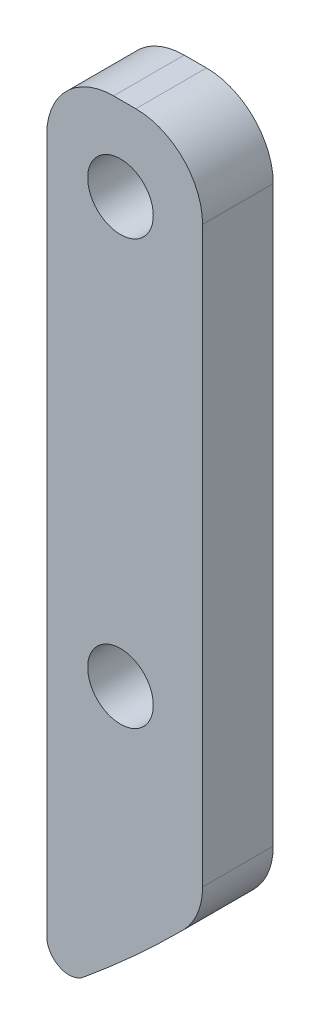
ISO-10303-21;
HEADER;
FILE_DESCRIPTION(('STEP AP214'),'2;1');
FILE_NAME('part.step','',(''),(''),'','','');
FILE_SCHEMA(('AUTOMOTIVE_DESIGN { 1 0 10303 214 1 1 1 1 }'));
ENDSEC;
DATA;
#1=APPLICATION_CONTEXT('core data for automotive mechanical design processes');
#2=APPLICATION_PROTOCOL_DEFINITION('international standard','automotive_design',2000,#1);
#3=PRODUCT_CONTEXT('',#1,'mechanical');
#4=PRODUCT('Part','Part','',(#3));
#5=PRODUCT_RELATED_PRODUCT_CATEGORY('part','',(#4));
#6=PRODUCT_DEFINITION_FORMATION('','',#4);
#7=PRODUCT_DEFINITION_CONTEXT('part definition',#1,'design');
#8=PRODUCT_DEFINITION('design','',#6,#7);
#9=PRODUCT_DEFINITION_SHAPE('','',#8);
#10=(LENGTH_UNIT() NAMED_UNIT(*) SI_UNIT(.MILLI.,.METRE.));
#11=(NAMED_UNIT(*) PLANE_ANGLE_UNIT() SI_UNIT($,.RADIAN.));
#12=(NAMED_UNIT(*) SI_UNIT($,.STERADIAN.) SOLID_ANGLE_UNIT());
#13=UNCERTAINTY_MEASURE_WITH_UNIT(LENGTH_MEASURE(1.E-05),#10,'distance_accuracy_value','');
#14=(GEOMETRIC_REPRESENTATION_CONTEXT(3) GLOBAL_UNCERTAINTY_ASSIGNED_CONTEXT((#13)) GLOBAL_UNIT_ASSIGNED_CONTEXT((#10,
#11,#12)) REPRESENTATION_CONTEXT('',''));
#15=CARTESIAN_POINT('',(0.,0.,0.));
#16=DIRECTION('',(0.,0.,1.));
#17=DIRECTION('',(1.,0.,0.));
#18=AXIS2_PLACEMENT_3D('',#15,#16,#17);
#19=CARTESIAN_POINT('',(-6.92429051442528E-10,7.03290897741127E-09,3.175));
#20=DIRECTION('',(0.,0.,1.));
#21=DIRECTION('',(1.,0.,0.));
#22=AXIS2_PLACEMENT_3D('',#19,#20,#21);
#23=PLANE('',#22);
#24=CARTESIAN_POINT('',(40.8118922104986,-16.3543111861162,3.175));
#25=DIRECTION('',(0.,0.,1.));
#26=DIRECTION('',(1.,0.,0.));
#27=AXIS2_PLACEMENT_3D('',#24,#25,#26);
#28=CIRCLE('',#27,1.4732);
#29=CARTESIAN_POINT('',(42.2850922104986,-16.3543111861162,3.175));
#30=VERTEX_POINT('',#29);
#31=EDGE_CURVE('E141',#30,#30,#28,.T.);
#32=ORIENTED_EDGE('',*,*,#31,.F.);
#33=EDGE_LOOP('',(#32));
#34=FACE_BOUND('',#33,.T.);
#35=DIRECTION('',(0.,-1.,0.));
#36=VECTOR('',#35,1.);
#37=CARTESIAN_POINT('',(37.5,-12.5874867185186,3.175));
#38=LINE('',#37,#36);
#39=CARTESIAN_POINT('',(37.5,-15.5874867185186,3.175));
#40=VERTEX_POINT('',#39);
#41=CARTESIAN_POINT('',(37.5,-46.7921363579228,3.175));
#42=VERTEX_POINT('',#41);
#43=EDGE_CURVE('E125',#40,#42,#38,.T.);
#44=ORIENTED_EDGE('',*,*,#43,.T.);
#45=CARTESIAN_POINT('',(38.5,-46.7921363579228,3.175));
#46=DIRECTION('',(0.,0.,1.));
#47=DIRECTION('',(1.,0.,0.));
#48=AXIS2_PLACEMENT_3D('',#45,#46,#47);
#49=CIRCLE('',#48,1.);
#50=CARTESIAN_POINT('',(39.1353659542418,-47.5643475364163,3.175));
#51=VERTEX_POINT('',#50);
#52=EDGE_CURVE('E12',#42,#51,#49,.T.);
#53=ORIENTED_EDGE('',*,*,#52,.T.);
#54=CARTESIAN_POINT('',(-6.92429051442528E-10,7.03290897741127E-09,3.175));
#55=DIRECTION('',(0.,0.,1.));
#56=DIRECTION('',(1.,0.,0.));
#57=AXIS2_PLACEMENT_3D('',#54,#55,#56);
#58=CIRCLE('',#57,61.5950000053629);
#59=CARTESIAN_POINT('',(43.6247546717413,-43.4836153604894,3.175));
#60=VERTEX_POINT('',#59);
#61=EDGE_CURVE('E205',#51,#60,#58,.T.);
#62=ORIENTED_EDGE('',*,*,#61,.T.);
#63=CARTESIAN_POINT('',(41.5,-41.3657349141673,3.175));
#64=DIRECTION('',(0.,0.,1.));
#65=DIRECTION('',(1.,0.,0.));
#66=AXIS2_PLACEMENT_3D('',#63,#64,#65);
#67=CIRCLE('',#66,3.);
#68=CARTESIAN_POINT('',(44.5,-41.3657349141673,3.175));
#69=VERTEX_POINT('',#68);
#70=EDGE_CURVE('E159',#60,#69,#67,.T.);
#71=ORIENTED_EDGE('',*,*,#70,.T.);
#72=DIRECTION('',(0.,1.,0.));
#73=VECTOR('',#72,1.);
#74=CARTESIAN_POINT('',(44.5,-41.3657349141671,3.175));
#75=LINE('',#74,#73);
#76=CARTESIAN_POINT('',(44.4999999999994,-15.5874867185186,3.175));
#77=VERTEX_POINT('',#76);
#78=EDGE_CURVE('E128',#69,#77,#75,.T.);
#79=ORIENTED_EDGE('',*,*,#78,.T.);
#80=CARTESIAN_POINT('',(41.5,-15.5874867185186,3.175));
#81=DIRECTION('',(0.,0.,1.));
#82=DIRECTION('',(1.,0.,0.));
#83=AXIS2_PLACEMENT_3D('',#80,#81,#82);
#84=CIRCLE('',#83,3.);
#85=CARTESIAN_POINT('',(41.5,-12.5874867185186,3.175));
#86=VERTEX_POINT('',#85);
#87=EDGE_CURVE('E162',#77,#86,#84,.T.);
#88=ORIENTED_EDGE('',*,*,#87,.T.);
#89=DIRECTION('',(-1.,0.,0.));
#90=VECTOR('',#89,1.);
#91=CARTESIAN_POINT('',(44.5,-12.5874867185186,3.175));
#92=LINE('',#91,#90);
#93=CARTESIAN_POINT('',(40.5,-12.5874867185186,3.175));
#94=VERTEX_POINT('',#93);
#95=EDGE_CURVE('E147',#86,#94,#92,.T.);
#96=ORIENTED_EDGE('',*,*,#95,.T.);
#97=CARTESIAN_POINT('',(40.5,-15.5874867185186,3.175));
#98=DIRECTION('',(0.,0.,1.));
#99=DIRECTION('',(1.,0.,0.));
#100=AXIS2_PLACEMENT_3D('',#97,#98,#99);
#101=CIRCLE('',#100,3.);
#102=EDGE_CURVE('E165',#94,#40,#101,.T.);
#103=ORIENTED_EDGE('',*,*,#102,.T.);
#104=EDGE_LOOP('',(#44,#53,#62,#71,#79,#88,#96,#103));
#105=FACE_BOUND('',#104,.T.);
#106=CARTESIAN_POINT('',(40.8118922104986,-35.4043111861162,3.175));
#107=DIRECTION('',(0.,0.,1.));
#108=DIRECTION('',(1.,0.,0.));
#109=AXIS2_PLACEMENT_3D('',#106,#107,#108);
#110=CIRCLE('',#109,1.4732);
#111=CARTESIAN_POINT('',(42.2850922104986,-35.4043111861162,3.175));
#112=VERTEX_POINT('',#111);
#113=EDGE_CURVE('E225',#112,#112,#110,.T.);
#114=ORIENTED_EDGE('',*,*,#113,.F.);
#115=EDGE_LOOP('',(#114));
#116=FACE_BOUND('',#115,.T.);
#117=ADVANCED_FACE('F45',(#34,#105,#116),#23,.T.);
#118=CARTESIAN_POINT('',(-6.92429051442528E-10,7.03290897741127E-09,0.));
#119=DIRECTION('',(0.,0.,1.));
#120=DIRECTION('',(1.,0.,0.));
#121=AXIS2_PLACEMENT_3D('',#118,#119,#120);
#122=PLANE('',#121);
#123=CARTESIAN_POINT('',(-6.92429051442528E-10,7.03290897741127E-09,0.));
#124=DIRECTION('',(0.,0.,1.));
#125=DIRECTION('',(1.,0.,0.));
#126=AXIS2_PLACEMENT_3D('',#123,#124,#125);
#127=CIRCLE('',#126,61.5950000053629);
#128=CARTESIAN_POINT('',(39.1353659542418,-47.5643475364163,0.));
#129=VERTEX_POINT('',#128);
#130=CARTESIAN_POINT('',(43.6247546717413,-43.4836153604894,0.));
#131=VERTEX_POINT('',#130);
#132=EDGE_CURVE('E133',#129,#131,#127,.T.);
#133=ORIENTED_EDGE('',*,*,#132,.F.);
#134=CARTESIAN_POINT('',(38.5,-46.7921363579228,0.));
#135=DIRECTION('',(0.,0.,1.));
#136=DIRECTION('',(1.,0.,0.));
#137=AXIS2_PLACEMENT_3D('',#134,#135,#136);
#138=CIRCLE('',#137,1.);
#139=CARTESIAN_POINT('',(37.5,-46.7921363579228,0.));
#140=VERTEX_POINT('',#139);
#141=EDGE_CURVE('E68',#129,#140,#138,.F.);
#142=ORIENTED_EDGE('',*,*,#141,.T.);
#143=DIRECTION('',(0.,-1.,0.));
#144=VECTOR('',#143,1.);
#145=CARTESIAN_POINT('',(37.5,-12.5874867185186,0.));
#146=LINE('',#145,#144);
#147=CARTESIAN_POINT('',(37.5,-15.5874867185186,0.));
#148=VERTEX_POINT('',#147);
#149=EDGE_CURVE('E124',#148,#140,#146,.T.);
#150=ORIENTED_EDGE('',*,*,#149,.F.);
#151=CARTESIAN_POINT('',(40.5,-15.5874867185186,0.));
#152=DIRECTION('',(0.,0.,1.));
#153=DIRECTION('',(1.,0.,0.));
#154=AXIS2_PLACEMENT_3D('',#151,#152,#153);
#155=CIRCLE('',#154,3.);
#156=CARTESIAN_POINT('',(40.5,-12.5874867185186,0.));
#157=VERTEX_POINT('',#156);
#158=EDGE_CURVE('E111',#148,#157,#155,.F.);
#159=ORIENTED_EDGE('',*,*,#158,.T.);
#160=DIRECTION('',(-1.,0.,0.));
#161=VECTOR('',#160,1.);
#162=CARTESIAN_POINT('',(44.5,-12.5874867185186,0.));
#163=LINE('',#162,#161);
#164=CARTESIAN_POINT('',(41.5,-12.5874867185186,0.));
#165=VERTEX_POINT('',#164);
#166=EDGE_CURVE('E134',#165,#157,#163,.T.);
#167=ORIENTED_EDGE('',*,*,#166,.F.);
#168=CARTESIAN_POINT('',(41.5,-15.5874867185186,0.));
#169=DIRECTION('',(0.,0.,1.));
#170=DIRECTION('',(1.,0.,0.));
#171=AXIS2_PLACEMENT_3D('',#168,#169,#170);
#172=CIRCLE('',#171,3.);
#173=CARTESIAN_POINT('',(44.5,-15.5874867185186,0.));
#174=VERTEX_POINT('',#173);
#175=EDGE_CURVE('E121',#165,#174,#172,.F.);
#176=ORIENTED_EDGE('',*,*,#175,.T.);
#177=DIRECTION('',(0.,1.,0.));
#178=VECTOR('',#177,1.);
#179=CARTESIAN_POINT('',(44.5,-15.5874867185186,0.));
#180=LINE('',#179,#178);
#181=CARTESIAN_POINT('',(44.5,-41.3657349141673,0.));
#182=VERTEX_POINT('',#181);
#183=EDGE_CURVE('E139',#182,#174,#180,.T.);
#184=ORIENTED_EDGE('',*,*,#183,.F.);
#185=CARTESIAN_POINT('',(41.5,-41.3657349141673,0.));
#186=DIRECTION('',(0.,0.,1.));
#187=DIRECTION('',(1.,0.,0.));
#188=AXIS2_PLACEMENT_3D('',#185,#186,#187);
#189=CIRCLE('',#188,3.);
#190=EDGE_CURVE('E127',#182,#131,#189,.F.);
#191=ORIENTED_EDGE('',*,*,#190,.T.);
#192=EDGE_LOOP('',(#133,#142,#150,#159,#167,#176,#184,#191));
#193=FACE_BOUND('',#192,.T.);
#194=CARTESIAN_POINT('',(40.8118922104986,-16.3543111861162,0.));
#195=DIRECTION('',(0.,0.,1.));
#196=DIRECTION('',(1.,0.,0.));
#197=AXIS2_PLACEMENT_3D('',#194,#195,#196);
#198=CIRCLE('',#197,1.4732);
#199=CARTESIAN_POINT('',(42.2850922104986,-16.3543111861162,0.));
#200=VERTEX_POINT('',#199);
#201=EDGE_CURVE('E220',#200,#200,#198,.T.);
#202=ORIENTED_EDGE('',*,*,#201,.T.);
#203=EDGE_LOOP('',(#202));
#204=FACE_BOUND('',#203,.T.);
#205=CARTESIAN_POINT('',(40.8118922104986,-35.4043111861162,0.));
#206=DIRECTION('',(0.,0.,1.));
#207=DIRECTION('',(1.,0.,0.));
#208=AXIS2_PLACEMENT_3D('',#205,#206,#207);
#209=CIRCLE('',#208,1.4732);
#210=CARTESIAN_POINT('',(42.2850922104986,-35.4043111861162,0.));
#211=VERTEX_POINT('',#210);
#212=EDGE_CURVE('E229',#211,#211,#209,.T.);
#213=ORIENTED_EDGE('',*,*,#212,.T.);
#214=EDGE_LOOP('',(#213));
#215=FACE_BOUND('',#214,.T.);
#216=ADVANCED_FACE('F130',(#193,#204,#215),#122,.F.);
#217=CARTESIAN_POINT('',(44.5,-12.5874867185186,3.175));
#218=DIRECTION('',(0.,-1.,0.));
#219=DIRECTION('',(0.,0.,-1.));
#220=AXIS2_PLACEMENT_3D('',#217,#218,#219);
#221=PLANE('',#220);
#222=ORIENTED_EDGE('',*,*,#166,.T.);
#223=DIRECTION('',(0.,0.,-1.));
#224=VECTOR('',#223,1.);
#225=CARTESIAN_POINT('',(40.5,-12.5874867185186,3.175));
#226=LINE('',#225,#224);
#227=EDGE_CURVE('E116',#157,#94,#226,.F.);
#228=ORIENTED_EDGE('',*,*,#227,.T.);
#229=ORIENTED_EDGE('',*,*,#95,.F.);
#230=DIRECTION('',(0.,0.,-1.));
#231=VECTOR('',#230,1.);
#232=CARTESIAN_POINT('',(41.5,-12.5874867185186,3.175));
#233=LINE('',#232,#231);
#234=EDGE_CURVE('E120',#86,#165,#233,.T.);
#235=ORIENTED_EDGE('',*,*,#234,.T.);
#236=EDGE_LOOP('',(#222,#228,#229,#235));
#237=FACE_BOUND('',#236,.T.);
#238=ADVANCED_FACE('F247',(#237),#221,.F.);
#239=CARTESIAN_POINT('',(37.5,-12.5874867185186,3.175));
#240=DIRECTION('',(1.,0.,0.));
#241=DIRECTION('',(0.,0.,-1.));
#242=AXIS2_PLACEMENT_3D('',#239,#240,#241);
#243=PLANE('',#242);
#244=ORIENTED_EDGE('',*,*,#149,.T.);
#245=DIRECTION('',(0.,0.,-1.));
#246=VECTOR('',#245,1.);
#247=CARTESIAN_POINT('',(37.5,-46.7921363579228,3.175));
#248=LINE('',#247,#246);
#249=EDGE_CURVE('E54',#140,#42,#248,.F.);
#250=ORIENTED_EDGE('',*,*,#249,.T.);
#251=ORIENTED_EDGE('',*,*,#43,.F.);
#252=DIRECTION('',(0.,0.,-1.));
#253=VECTOR('',#252,1.);
#254=CARTESIAN_POINT('',(37.5,-15.5874867185186,3.175));
#255=LINE('',#254,#253);
#256=EDGE_CURVE('E115',#40,#148,#255,.T.);
#257=ORIENTED_EDGE('',*,*,#256,.T.);
#258=EDGE_LOOP('',(#244,#250,#251,#257));
#259=FACE_BOUND('',#258,.T.);
#260=ADVANCED_FACE('F123',(#259),#243,.F.);
#261=CARTESIAN_POINT('',(-6.92429051442528E-10,7.03290897741127E-09,3.175));
#262=DIRECTION('',(0.,0.,-1.));
#263=DIRECTION('',(-1.,0.,0.));
#264=AXIS2_PLACEMENT_3D('',#261,#262,#263);
#265=CYLINDRICAL_SURFACE('',#264,61.5950000053629);
#266=ORIENTED_EDGE('',*,*,#61,.F.);
#267=DIRECTION('',(0.,0.,-1.));
#268=VECTOR('',#267,1.);
#269=CARTESIAN_POINT('',(39.1353659542418,-47.5643475364163,3.175));
#270=LINE('',#269,#268);
#271=EDGE_CURVE('E179',#51,#129,#270,.T.);
#272=ORIENTED_EDGE('',*,*,#271,.T.);
#273=ORIENTED_EDGE('',*,*,#132,.T.);
#274=DIRECTION('',(0.,0.,-1.));
#275=VECTOR('',#274,1.);
#276=CARTESIAN_POINT('',(43.6247546717413,-43.4836153604894,3.175));
#277=LINE('',#276,#275);
#278=EDGE_CURVE('E175',#131,#60,#277,.F.);
#279=ORIENTED_EDGE('',*,*,#278,.T.);
#280=EDGE_LOOP('',(#266,#272,#273,#279));
#281=FACE_BOUND('',#280,.T.);
#282=ADVANCED_FACE('F257',(#281),#265,.T.);
#283=CARTESIAN_POINT('',(44.5,-15.5874867185186,3.175));
#284=DIRECTION('',(-1.,0.,0.));
#285=DIRECTION('',(0.,0.,1.));
#286=AXIS2_PLACEMENT_3D('',#283,#284,#285);
#287=PLANE('',#286);
#288=ORIENTED_EDGE('',*,*,#183,.T.);
#289=DIRECTION('',(0.,0.,-1.));
#290=VECTOR('',#289,1.);
#291=CARTESIAN_POINT('',(44.5,-15.5874867185186,3.175));
#292=LINE('',#291,#290);
#293=EDGE_CURVE('E172',#174,#77,#292,.F.);
#294=ORIENTED_EDGE('',*,*,#293,.T.);
#295=ORIENTED_EDGE('',*,*,#78,.F.);
#296=DIRECTION('',(0.,0.,-1.));
#297=VECTOR('',#296,1.);
#298=CARTESIAN_POINT('',(44.5,-41.3657349141673,3.175));
#299=LINE('',#298,#297);
#300=EDGE_CURVE('E168',#69,#182,#299,.T.);
#301=ORIENTED_EDGE('',*,*,#300,.T.);
#302=EDGE_LOOP('',(#288,#294,#295,#301));
#303=FACE_BOUND('',#302,.T.);
#304=ADVANCED_FACE('F254',(#303),#287,.F.);
#305=CARTESIAN_POINT('',(40.8118922104986,-16.3543111861162,3.175));
#306=DIRECTION('',(0.,0.,-1.));
#307=DIRECTION('',(-1.,0.,0.));
#308=AXIS2_PLACEMENT_3D('',#305,#306,#307);
#309=CYLINDRICAL_SURFACE('',#308,1.4732);
#310=ORIENTED_EDGE('',*,*,#31,.T.);
#311=EDGE_LOOP('',(#310));
#312=FACE_BOUND('',#311,.T.);
#313=ORIENTED_EDGE('',*,*,#201,.F.);
#314=EDGE_LOOP('',(#313));
#315=FACE_BOUND('',#314,.T.);
#316=ADVANCED_FACE('F251',(#312,#315),#309,.F.);
#317=CARTESIAN_POINT('',(40.8118922104986,-35.4043111861162,3.175));
#318=DIRECTION('',(0.,0.,-1.));
#319=DIRECTION('',(-1.,0.,0.));
#320=AXIS2_PLACEMENT_3D('',#317,#318,#319);
#321=CYLINDRICAL_SURFACE('',#320,1.4732);
#322=ORIENTED_EDGE('',*,*,#113,.T.);
#323=EDGE_LOOP('',(#322));
#324=FACE_BOUND('',#323,.T.);
#325=ORIENTED_EDGE('',*,*,#212,.F.);
#326=EDGE_LOOP('',(#325));
#327=FACE_BOUND('',#326,.T.);
#328=ADVANCED_FACE('F238',(#324,#327),#321,.F.);
#329=CARTESIAN_POINT('',(40.5,-15.5874867185186,3.175));
#330=DIRECTION('',(0.,0.,-1.));
#331=DIRECTION('',(-1.,0.,0.));
#332=AXIS2_PLACEMENT_3D('',#329,#330,#331);
#333=CYLINDRICAL_SURFACE('',#332,3.);
#334=ORIENTED_EDGE('',*,*,#102,.F.);
#335=ORIENTED_EDGE('',*,*,#227,.F.);
#336=ORIENTED_EDGE('',*,*,#158,.F.);
#337=ORIENTED_EDGE('',*,*,#256,.F.);
#338=EDGE_LOOP('',(#334,#335,#336,#337));
#339=FACE_BOUND('',#338,.T.);
#340=ADVANCED_FACE('F114',(#339),#333,.T.);
#341=CARTESIAN_POINT('',(41.5,-15.5874867185186,3.175));
#342=DIRECTION('',(0.,0.,-1.));
#343=DIRECTION('',(-1.,0.,0.));
#344=AXIS2_PLACEMENT_3D('',#341,#342,#343);
#345=CYLINDRICAL_SURFACE('',#344,3.);
#346=ORIENTED_EDGE('',*,*,#87,.F.);
#347=ORIENTED_EDGE('',*,*,#293,.F.);
#348=ORIENTED_EDGE('',*,*,#175,.F.);
#349=ORIENTED_EDGE('',*,*,#234,.F.);
#350=EDGE_LOOP('',(#346,#347,#348,#349));
#351=FACE_BOUND('',#350,.T.);
#352=ADVANCED_FACE('F269',(#351),#345,.T.);
#353=CARTESIAN_POINT('',(41.5,-41.3657349141673,3.175));
#354=DIRECTION('',(0.,0.,-1.));
#355=DIRECTION('',(-1.,0.,0.));
#356=AXIS2_PLACEMENT_3D('',#353,#354,#355);
#357=CYLINDRICAL_SURFACE('',#356,3.);
#358=ORIENTED_EDGE('',*,*,#70,.F.);
#359=ORIENTED_EDGE('',*,*,#278,.F.);
#360=ORIENTED_EDGE('',*,*,#190,.F.);
#361=ORIENTED_EDGE('',*,*,#300,.F.);
#362=EDGE_LOOP('',(#358,#359,#360,#361));
#363=FACE_BOUND('',#362,.T.);
#364=ADVANCED_FACE('F271',(#363),#357,.T.);
#365=CARTESIAN_POINT('',(38.5,-46.7921363579228,3.175));
#366=DIRECTION('',(0.,0.,-1.));
#367=DIRECTION('',(-1.,0.,0.));
#368=AXIS2_PLACEMENT_3D('',#365,#366,#367);
#369=CYLINDRICAL_SURFACE('',#368,1.);
#370=ORIENTED_EDGE('',*,*,#52,.F.);
#371=ORIENTED_EDGE('',*,*,#249,.F.);
#372=ORIENTED_EDGE('',*,*,#141,.F.);
#373=ORIENTED_EDGE('',*,*,#271,.F.);
#374=EDGE_LOOP('',(#370,#371,#372,#373));
#375=FACE_BOUND('',#374,.T.);
#376=ADVANCED_FACE('F47',(#375),#369,.T.);
#377=CLOSED_SHELL('',(#117,#216,#238,#260,#282,#304,#316,#328,#340,#352,#364,#376));
#378=MANIFOLD_SOLID_BREP('B2',#377);
#379=ADVANCED_BREP_SHAPE_REPRESENTATION('',(#18,#378),#14);
#380=SHAPE_DEFINITION_REPRESENTATION(#9,#379);
ENDSEC;
END-ISO-10303-21;
